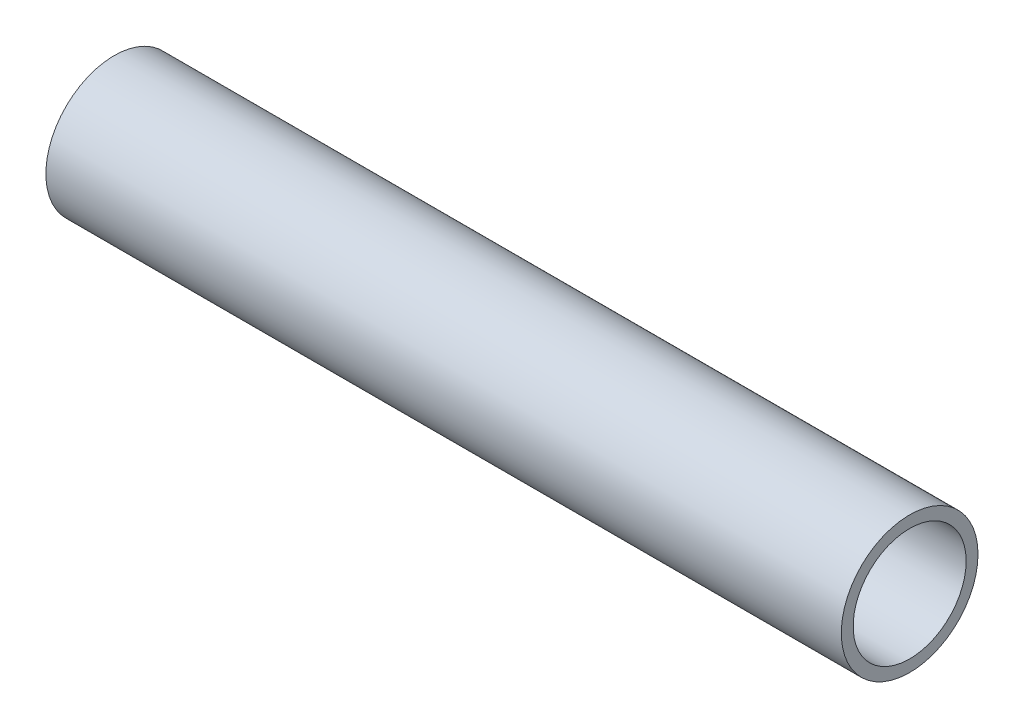
ISO-10303-21;
HEADER;
FILE_DESCRIPTION(('STEP AP214'),'2;1');
FILE_NAME('part.step','',(''),(''),'','','');
FILE_SCHEMA(('AUTOMOTIVE_DESIGN { 1 0 10303 214 1 1 1 1 }'));
ENDSEC;
DATA;
#1=APPLICATION_CONTEXT('core data for automotive mechanical design processes');
#2=APPLICATION_PROTOCOL_DEFINITION('international standard','automotive_design',2000,#1);
#3=PRODUCT_CONTEXT('',#1,'mechanical');
#4=PRODUCT('Part','Part','',(#3));
#5=PRODUCT_RELATED_PRODUCT_CATEGORY('part','',(#4));
#6=PRODUCT_DEFINITION_FORMATION('','',#4);
#7=PRODUCT_DEFINITION_CONTEXT('part definition',#1,'design');
#8=PRODUCT_DEFINITION('design','',#6,#7);
#9=PRODUCT_DEFINITION_SHAPE('','',#8);
#10=(LENGTH_UNIT() NAMED_UNIT(*) SI_UNIT(.MILLI.,.METRE.));
#11=(NAMED_UNIT(*) PLANE_ANGLE_UNIT() SI_UNIT($,.RADIAN.));
#12=(NAMED_UNIT(*) SI_UNIT($,.STERADIAN.) SOLID_ANGLE_UNIT());
#13=UNCERTAINTY_MEASURE_WITH_UNIT(LENGTH_MEASURE(1.E-05),#10,'distance_accuracy_value','');
#14=(GEOMETRIC_REPRESENTATION_CONTEXT(3) GLOBAL_UNCERTAINTY_ASSIGNED_CONTEXT((#13)) GLOBAL_UNIT_ASSIGNED_CONTEXT((#10,
#11,#12)) REPRESENTATION_CONTEXT('',''));
#15=CARTESIAN_POINT('',(0.,0.,0.));
#16=DIRECTION('',(0.,0.,1.));
#17=DIRECTION('',(1.,0.,0.));
#18=AXIS2_PLACEMENT_3D('',#15,#16,#17);
#19=CARTESIAN_POINT('',(55.4228,0.,0.));
#20=DIRECTION('',(1.,0.,0.));
#21=DIRECTION('',(0.,0.,-1.));
#22=AXIS2_PLACEMENT_3D('',#19,#20,#21);
#23=PLANE('',#22);
#24=CARTESIAN_POINT('',(55.4228,0.,0.));
#25=DIRECTION('',(1.,0.,0.));
#26=DIRECTION('',(0.,0.,-1.));
#27=AXIS2_PLACEMENT_3D('',#24,#25,#26);
#28=CIRCLE('',#27,9.525);
#29=CARTESIAN_POINT('',(55.4228,0.,-9.525));
#30=VERTEX_POINT('',#29);
#31=EDGE_CURVE('E10',#30,#30,#28,.T.);
#32=ORIENTED_EDGE('',*,*,#31,.T.);
#33=EDGE_LOOP('',(#32));
#34=FACE_BOUND('',#33,.T.);
#35=CARTESIAN_POINT('',(55.4228,0.,0.));
#36=DIRECTION('',(1.,0.,0.));
#37=DIRECTION('',(0.,0.,-1.));
#38=AXIS2_PLACEMENT_3D('',#35,#36,#37);
#39=CIRCLE('',#38,7.874);
#40=CARTESIAN_POINT('',(55.4228,0.,-7.874));
#41=VERTEX_POINT('',#40);
#42=EDGE_CURVE('E42',#41,#41,#39,.T.);
#43=ORIENTED_EDGE('',*,*,#42,.F.);
#44=EDGE_LOOP('',(#43));
#45=FACE_BOUND('',#44,.T.);
#46=ADVANCED_FACE('F31',(#34,#45),#23,.T.);
#47=CARTESIAN_POINT('',(-55.4228,0.,0.));
#48=DIRECTION('',(1.,0.,0.));
#49=DIRECTION('',(0.,0.,-1.));
#50=AXIS2_PLACEMENT_3D('',#47,#48,#49);
#51=PLANE('',#50);
#52=CARTESIAN_POINT('',(-55.4228,0.,0.));
#53=DIRECTION('',(1.,0.,0.));
#54=DIRECTION('',(0.,0.,-1.));
#55=AXIS2_PLACEMENT_3D('',#52,#53,#54);
#56=CIRCLE('',#55,9.525);
#57=CARTESIAN_POINT('',(-55.4228,0.,-9.525));
#58=VERTEX_POINT('',#57);
#59=EDGE_CURVE('E35',#58,#58,#56,.T.);
#60=ORIENTED_EDGE('',*,*,#59,.F.);
#61=EDGE_LOOP('',(#60));
#62=FACE_BOUND('',#61,.T.);
#63=CARTESIAN_POINT('',(-55.4228,0.,0.));
#64=DIRECTION('',(1.,0.,0.));
#65=DIRECTION('',(0.,0.,-1.));
#66=AXIS2_PLACEMENT_3D('',#63,#64,#65);
#67=CIRCLE('',#66,7.874);
#68=CARTESIAN_POINT('',(-55.4228,0.,-7.874));
#69=VERTEX_POINT('',#68);
#70=EDGE_CURVE('E44',#69,#69,#67,.T.);
#71=ORIENTED_EDGE('',*,*,#70,.T.);
#72=EDGE_LOOP('',(#71));
#73=FACE_BOUND('',#72,.T.);
#74=ADVANCED_FACE('F54',(#62,#73),#51,.F.);
#75=CARTESIAN_POINT('',(55.4228,0.,0.));
#76=DIRECTION('',(-1.,0.,0.));
#77=DIRECTION('',(0.,0.,1.));
#78=AXIS2_PLACEMENT_3D('',#75,#76,#77);
#79=CYLINDRICAL_SURFACE('',#78,9.525);
#80=ORIENTED_EDGE('',*,*,#31,.F.);
#81=EDGE_LOOP('',(#80));
#82=FACE_BOUND('',#81,.T.);
#83=ORIENTED_EDGE('',*,*,#59,.T.);
#84=EDGE_LOOP('',(#83));
#85=FACE_BOUND('',#84,.T.);
#86=ADVANCED_FACE('F33',(#82,#85),#79,.T.);
#87=CARTESIAN_POINT('',(55.4228,0.,0.));
#88=DIRECTION('',(-1.,0.,0.));
#89=DIRECTION('',(0.,0.,1.));
#90=AXIS2_PLACEMENT_3D('',#87,#88,#89);
#91=CYLINDRICAL_SURFACE('',#90,7.874);
#92=ORIENTED_EDGE('',*,*,#42,.T.);
#93=EDGE_LOOP('',(#92));
#94=FACE_BOUND('',#93,.T.);
#95=ORIENTED_EDGE('',*,*,#70,.F.);
#96=EDGE_LOOP('',(#95));
#97=FACE_BOUND('',#96,.T.);
#98=ADVANCED_FACE('F50',(#94,#97),#91,.F.);
#99=CLOSED_SHELL('',(#46,#74,#86,#98));
#100=MANIFOLD_SOLID_BREP('B2',#99);
#101=ADVANCED_BREP_SHAPE_REPRESENTATION('',(#18,#100),#14);
#102=SHAPE_DEFINITION_REPRESENTATION(#9,#101);
ENDSEC;
END-ISO-10303-21;
